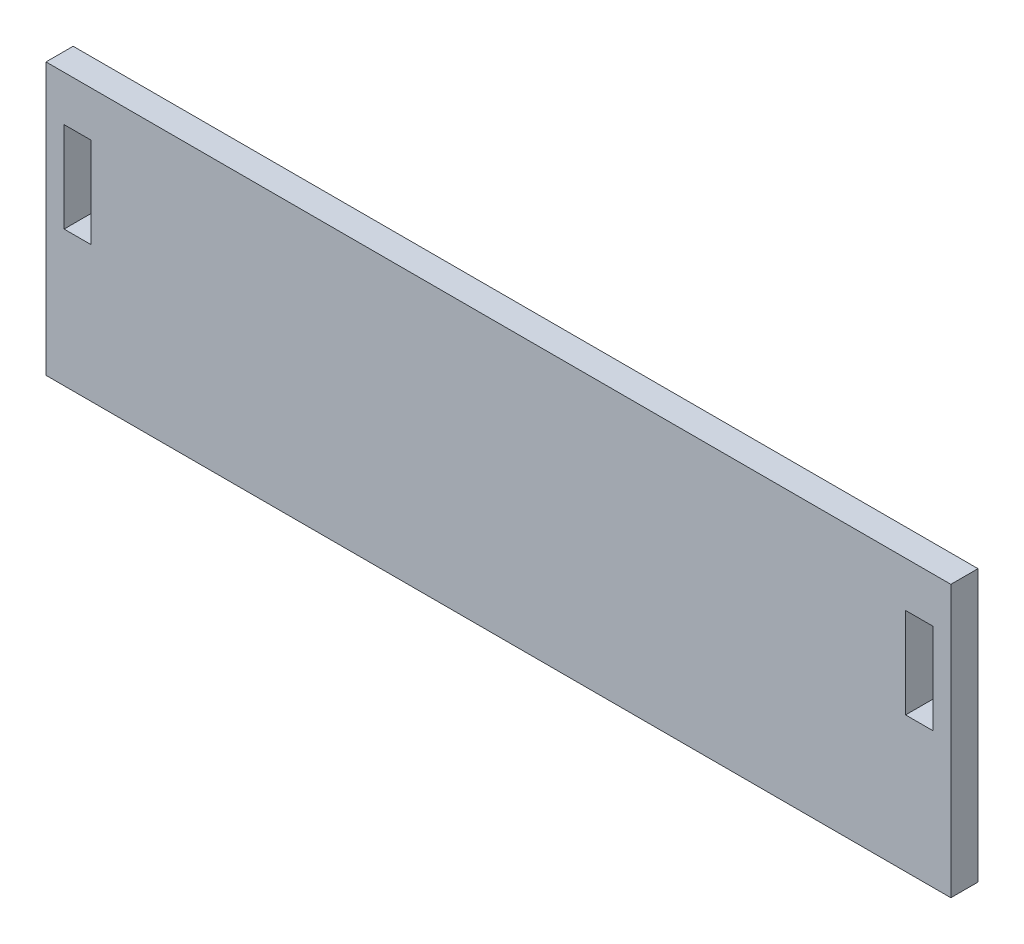
ISO-10303-21;
HEADER;
FILE_DESCRIPTION(('STEP AP214'),'2;1');
FILE_NAME('part.step','',(''),(''),'','','');
FILE_SCHEMA(('AUTOMOTIVE_DESIGN { 1 0 10303 214 1 1 1 1 }'));
ENDSEC;
DATA;
#1=APPLICATION_CONTEXT('core data for automotive mechanical design processes');
#2=APPLICATION_PROTOCOL_DEFINITION('international standard','automotive_design',2000,#1);
#3=PRODUCT_CONTEXT('',#1,'mechanical');
#4=PRODUCT('Part','Part','',(#3));
#5=PRODUCT_RELATED_PRODUCT_CATEGORY('part','',(#4));
#6=PRODUCT_DEFINITION_FORMATION('','',#4);
#7=PRODUCT_DEFINITION_CONTEXT('part definition',#1,'design');
#8=PRODUCT_DEFINITION('design','',#6,#7);
#9=PRODUCT_DEFINITION_SHAPE('','',#8);
#10=(LENGTH_UNIT() NAMED_UNIT(*) SI_UNIT(.MILLI.,.METRE.));
#11=(NAMED_UNIT(*) PLANE_ANGLE_UNIT() SI_UNIT($,.RADIAN.));
#12=(NAMED_UNIT(*) SI_UNIT($,.STERADIAN.) SOLID_ANGLE_UNIT());
#13=UNCERTAINTY_MEASURE_WITH_UNIT(LENGTH_MEASURE(1.E-05),#10,'distance_accuracy_value','');
#14=(GEOMETRIC_REPRESENTATION_CONTEXT(3) GLOBAL_UNCERTAINTY_ASSIGNED_CONTEXT((#13)) GLOBAL_UNIT_ASSIGNED_CONTEXT((#10,
#11,#12)) REPRESENTATION_CONTEXT('',''));
#15=CARTESIAN_POINT('',(0.,0.,0.));
#16=DIRECTION('',(0.,0.,1.));
#17=DIRECTION('',(1.,0.,0.));
#18=AXIS2_PLACEMENT_3D('',#15,#16,#17);
#19=CARTESIAN_POINT('',(0.,0.,3.));
#20=DIRECTION('',(0.,0.,-1.));
#21=DIRECTION('',(-1.,0.,0.));
#22=AXIS2_PLACEMENT_3D('',#19,#20,#21);
#23=PLANE('',#22);
#24=DIRECTION('',(0.,1.,0.));
#25=VECTOR('',#24,1.);
#26=CARTESIAN_POINT('',(-45.,10.,3.));
#27=LINE('',#26,#25);
#28=CARTESIAN_POINT('',(-45.,0.,3.));
#29=VERTEX_POINT('',#28);
#30=CARTESIAN_POINT('',(-45.,10.,3.));
#31=VERTEX_POINT('',#30);
#32=EDGE_CURVE('E158',#29,#31,#27,.T.);
#33=ORIENTED_EDGE('',*,*,#32,.F.);
#34=DIRECTION('',(1.,0.,0.));
#35=VECTOR('',#34,1.);
#36=CARTESIAN_POINT('',(-48.,0.,3.));
#37=LINE('',#36,#35);
#38=CARTESIAN_POINT('',(-48.,0.,3.));
#39=VERTEX_POINT('',#38);
#40=EDGE_CURVE('E166',#39,#29,#37,.T.);
#41=ORIENTED_EDGE('',*,*,#40,.F.);
#42=DIRECTION('',(0.,-1.,0.));
#43=VECTOR('',#42,1.);
#44=CARTESIAN_POINT('',(-48.,10.,3.));
#45=LINE('',#44,#43);
#46=CARTESIAN_POINT('',(-48.,10.,3.));
#47=VERTEX_POINT('',#46);
#48=EDGE_CURVE('E163',#47,#39,#45,.T.);
#49=ORIENTED_EDGE('',*,*,#48,.F.);
#50=DIRECTION('',(-1.,0.,0.));
#51=VECTOR('',#50,1.);
#52=CARTESIAN_POINT('',(-48.,10.,3.));
#53=LINE('',#52,#51);
#54=EDGE_CURVE('E160',#31,#47,#53,.T.);
#55=ORIENTED_EDGE('',*,*,#54,.F.);
#56=EDGE_LOOP('',(#33,#41,#49,#55));
#57=FACE_BOUND('',#56,.T.);
#58=DIRECTION('',(0.,-1.,0.));
#59=VECTOR('',#58,1.);
#60=CARTESIAN_POINT('',(-50.,15.,3.));
#61=LINE('',#60,#59);
#62=CARTESIAN_POINT('',(-50.,15.,3.));
#63=VERTEX_POINT('',#62);
#64=CARTESIAN_POINT('',(-50.,-15.,3.));
#65=VERTEX_POINT('',#64);
#66=EDGE_CURVE('E189',#63,#65,#61,.T.);
#67=ORIENTED_EDGE('',*,*,#66,.T.);
#68=DIRECTION('',(1.,0.,0.));
#69=VECTOR('',#68,1.);
#70=CARTESIAN_POINT('',(50.,-15.,3.));
#71=LINE('',#70,#69);
#72=CARTESIAN_POINT('',(50.,-15.,3.));
#73=VERTEX_POINT('',#72);
#74=EDGE_CURVE('E192',#65,#73,#71,.T.);
#75=ORIENTED_EDGE('',*,*,#74,.T.);
#76=DIRECTION('',(0.,1.,0.));
#77=VECTOR('',#76,1.);
#78=CARTESIAN_POINT('',(50.,15.,3.));
#79=LINE('',#78,#77);
#80=CARTESIAN_POINT('',(50.,15.,3.));
#81=VERTEX_POINT('',#80);
#82=EDGE_CURVE('E195',#73,#81,#79,.T.);
#83=ORIENTED_EDGE('',*,*,#82,.T.);
#84=DIRECTION('',(-1.,0.,0.));
#85=VECTOR('',#84,1.);
#86=CARTESIAN_POINT('',(50.,15.,3.));
#87=LINE('',#86,#85);
#88=EDGE_CURVE('E197',#81,#63,#87,.T.);
#89=ORIENTED_EDGE('',*,*,#88,.T.);
#90=EDGE_LOOP('',(#67,#75,#83,#89));
#91=FACE_BOUND('',#90,.T.);
#92=DIRECTION('',(0.,1.,0.));
#93=VECTOR('',#92,1.);
#94=CARTESIAN_POINT('',(48.,10.,3.));
#95=LINE('',#94,#93);
#96=CARTESIAN_POINT('',(48.,0.,3.));
#97=VERTEX_POINT('',#96);
#98=CARTESIAN_POINT('',(48.,10.,3.));
#99=VERTEX_POINT('',#98);
#100=EDGE_CURVE('E122',#97,#99,#95,.T.);
#101=ORIENTED_EDGE('',*,*,#100,.F.);
#102=DIRECTION('',(1.,0.,0.));
#103=VECTOR('',#102,1.);
#104=CARTESIAN_POINT('',(45.,0.,3.));
#105=LINE('',#104,#103);
#106=CARTESIAN_POINT('',(45.,0.,3.));
#107=VERTEX_POINT('',#106);
#108=EDGE_CURVE('E144',#107,#97,#105,.T.);
#109=ORIENTED_EDGE('',*,*,#108,.F.);
#110=DIRECTION('',(0.,-1.,0.));
#111=VECTOR('',#110,1.);
#112=CARTESIAN_POINT('',(45.,10.,3.));
#113=LINE('',#112,#111);
#114=CARTESIAN_POINT('',(45.,10.,3.));
#115=VERTEX_POINT('',#114);
#116=EDGE_CURVE('E142',#115,#107,#113,.T.);
#117=ORIENTED_EDGE('',*,*,#116,.F.);
#118=DIRECTION('',(-1.,0.,0.));
#119=VECTOR('',#118,1.);
#120=CARTESIAN_POINT('',(45.,10.,3.));
#121=LINE('',#120,#119);
#122=EDGE_CURVE('E130',#99,#115,#121,.T.);
#123=ORIENTED_EDGE('',*,*,#122,.F.);
#124=EDGE_LOOP('',(#101,#109,#117,#123));
#125=FACE_BOUND('',#124,.T.);
#126=ADVANCED_FACE('F33',(#57,#91,#125),#23,.F.);
#127=CARTESIAN_POINT('',(0.,0.,0.));
#128=DIRECTION('',(0.,0.,-1.));
#129=DIRECTION('',(-1.,0.,0.));
#130=AXIS2_PLACEMENT_3D('',#127,#128,#129);
#131=PLANE('',#130);
#132=DIRECTION('',(0.,-1.,0.));
#133=VECTOR('',#132,1.);
#134=CARTESIAN_POINT('',(-50.,15.,0.));
#135=LINE('',#134,#133);
#136=CARTESIAN_POINT('',(-50.,15.,0.));
#137=VERTEX_POINT('',#136);
#138=CARTESIAN_POINT('',(-50.,-15.,0.));
#139=VERTEX_POINT('',#138);
#140=EDGE_CURVE('E188',#137,#139,#135,.T.);
#141=ORIENTED_EDGE('',*,*,#140,.F.);
#142=DIRECTION('',(-1.,0.,0.));
#143=VECTOR('',#142,1.);
#144=CARTESIAN_POINT('',(50.,15.,0.));
#145=LINE('',#144,#143);
#146=CARTESIAN_POINT('',(50.,15.,0.));
#147=VERTEX_POINT('',#146);
#148=EDGE_CURVE('E193',#147,#137,#145,.T.);
#149=ORIENTED_EDGE('',*,*,#148,.F.);
#150=DIRECTION('',(0.,1.,0.));
#151=VECTOR('',#150,1.);
#152=CARTESIAN_POINT('',(50.,15.,0.));
#153=LINE('',#152,#151);
#154=CARTESIAN_POINT('',(50.,-15.,0.));
#155=VERTEX_POINT('',#154);
#156=EDGE_CURVE('E204',#155,#147,#153,.T.);
#157=ORIENTED_EDGE('',*,*,#156,.F.);
#158=DIRECTION('',(1.,0.,0.));
#159=VECTOR('',#158,1.);
#160=CARTESIAN_POINT('',(50.,-15.,0.));
#161=LINE('',#160,#159);
#162=EDGE_CURVE('E202',#139,#155,#161,.T.);
#163=ORIENTED_EDGE('',*,*,#162,.F.);
#164=EDGE_LOOP('',(#141,#149,#157,#163));
#165=FACE_BOUND('',#164,.T.);
#166=DIRECTION('',(1.,0.,0.));
#167=VECTOR('',#166,1.);
#168=CARTESIAN_POINT('',(-48.,0.,0.));
#169=LINE('',#168,#167);
#170=CARTESIAN_POINT('',(-48.,0.,0.));
#171=VERTEX_POINT('',#170);
#172=CARTESIAN_POINT('',(-45.,0.,0.));
#173=VERTEX_POINT('',#172);
#174=EDGE_CURVE('E161',#171,#173,#169,.T.);
#175=ORIENTED_EDGE('',*,*,#174,.T.);
#176=DIRECTION('',(0.,1.,0.));
#177=VECTOR('',#176,1.);
#178=CARTESIAN_POINT('',(-45.,10.,0.));
#179=LINE('',#178,#177);
#180=CARTESIAN_POINT('',(-45.,10.,0.));
#181=VERTEX_POINT('',#180);
#182=EDGE_CURVE('E138',#173,#181,#179,.T.);
#183=ORIENTED_EDGE('',*,*,#182,.T.);
#184=DIRECTION('',(-1.,0.,0.));
#185=VECTOR('',#184,1.);
#186=CARTESIAN_POINT('',(-48.,10.,0.));
#187=LINE('',#186,#185);
#188=CARTESIAN_POINT('',(-48.,10.,0.));
#189=VERTEX_POINT('',#188);
#190=EDGE_CURVE('E171',#181,#189,#187,.T.);
#191=ORIENTED_EDGE('',*,*,#190,.T.);
#192=DIRECTION('',(0.,-1.,0.));
#193=VECTOR('',#192,1.);
#194=CARTESIAN_POINT('',(-48.,10.,0.));
#195=LINE('',#194,#193);
#196=EDGE_CURVE('E174',#189,#171,#195,.T.);
#197=ORIENTED_EDGE('',*,*,#196,.T.);
#198=EDGE_LOOP('',(#175,#183,#191,#197));
#199=FACE_BOUND('',#198,.T.);
#200=DIRECTION('',(1.,0.,0.));
#201=VECTOR('',#200,1.);
#202=CARTESIAN_POINT('',(45.,0.,0.));
#203=LINE('',#202,#201);
#204=CARTESIAN_POINT('',(45.,0.,0.));
#205=VERTEX_POINT('',#204);
#206=CARTESIAN_POINT('',(48.,0.,0.));
#207=VERTEX_POINT('',#206);
#208=EDGE_CURVE('E131',#205,#207,#203,.T.);
#209=ORIENTED_EDGE('',*,*,#208,.T.);
#210=DIRECTION('',(0.,1.,0.));
#211=VECTOR('',#210,1.);
#212=CARTESIAN_POINT('',(48.,10.,0.));
#213=LINE('',#212,#211);
#214=CARTESIAN_POINT('',(48.,10.,0.));
#215=VERTEX_POINT('',#214);
#216=EDGE_CURVE('E56',#207,#215,#213,.T.);
#217=ORIENTED_EDGE('',*,*,#216,.T.);
#218=DIRECTION('',(-1.,0.,0.));
#219=VECTOR('',#218,1.);
#220=CARTESIAN_POINT('',(45.,10.,0.));
#221=LINE('',#220,#219);
#222=CARTESIAN_POINT('',(45.,10.,0.));
#223=VERTEX_POINT('',#222);
#224=EDGE_CURVE('E137',#215,#223,#221,.T.);
#225=ORIENTED_EDGE('',*,*,#224,.T.);
#226=DIRECTION('',(0.,-1.,0.));
#227=VECTOR('',#226,1.);
#228=CARTESIAN_POINT('',(45.,10.,0.));
#229=LINE('',#228,#227);
#230=EDGE_CURVE('E150',#223,#205,#229,.T.);
#231=ORIENTED_EDGE('',*,*,#230,.T.);
#232=EDGE_LOOP('',(#209,#217,#225,#231));
#233=FACE_BOUND('',#232,.T.);
#234=ADVANCED_FACE('F222',(#165,#199,#233),#131,.T.);
#235=CARTESIAN_POINT('',(-50.,15.,3.));
#236=DIRECTION('',(1.,0.,0.));
#237=DIRECTION('',(0.,1.,0.));
#238=AXIS2_PLACEMENT_3D('',#235,#236,#237);
#239=PLANE('',#238);
#240=ORIENTED_EDGE('',*,*,#140,.T.);
#241=DIRECTION('',(0.,0.,-1.));
#242=VECTOR('',#241,1.);
#243=CARTESIAN_POINT('',(-50.,-15.,3.));
#244=LINE('',#243,#242);
#245=EDGE_CURVE('E11',#65,#139,#244,.T.);
#246=ORIENTED_EDGE('',*,*,#245,.F.);
#247=ORIENTED_EDGE('',*,*,#66,.F.);
#248=DIRECTION('',(0.,0.,-1.));
#249=VECTOR('',#248,1.);
#250=CARTESIAN_POINT('',(-50.,15.,3.));
#251=LINE('',#250,#249);
#252=EDGE_CURVE('E199',#63,#137,#251,.T.);
#253=ORIENTED_EDGE('',*,*,#252,.T.);
#254=EDGE_LOOP('',(#240,#246,#247,#253));
#255=FACE_BOUND('',#254,.T.);
#256=ADVANCED_FACE('F35',(#255),#239,.F.);
#257=CARTESIAN_POINT('',(50.,-15.,3.));
#258=DIRECTION('',(0.,1.,0.));
#259=DIRECTION('',(-1.,0.,0.));
#260=AXIS2_PLACEMENT_3D('',#257,#258,#259);
#261=PLANE('',#260);
#262=ORIENTED_EDGE('',*,*,#162,.T.);
#263=DIRECTION('',(0.,0.,-1.));
#264=VECTOR('',#263,1.);
#265=CARTESIAN_POINT('',(50.,-15.,3.));
#266=LINE('',#265,#264);
#267=EDGE_CURVE('E41',#73,#155,#266,.T.);
#268=ORIENTED_EDGE('',*,*,#267,.F.);
#269=ORIENTED_EDGE('',*,*,#74,.F.);
#270=ORIENTED_EDGE('',*,*,#245,.T.);
#271=EDGE_LOOP('',(#262,#268,#269,#270));
#272=FACE_BOUND('',#271,.T.);
#273=ADVANCED_FACE('F232',(#272),#261,.F.);
#274=CARTESIAN_POINT('',(50.,15.,3.));
#275=DIRECTION('',(-1.,0.,0.));
#276=DIRECTION('',(0.,-1.,0.));
#277=AXIS2_PLACEMENT_3D('',#274,#275,#276);
#278=PLANE('',#277);
#279=ORIENTED_EDGE('',*,*,#156,.T.);
#280=DIRECTION('',(0.,0.,-1.));
#281=VECTOR('',#280,1.);
#282=CARTESIAN_POINT('',(50.,15.,3.));
#283=LINE('',#282,#281);
#284=EDGE_CURVE('E209',#81,#147,#283,.T.);
#285=ORIENTED_EDGE('',*,*,#284,.F.);
#286=ORIENTED_EDGE('',*,*,#82,.F.);
#287=ORIENTED_EDGE('',*,*,#267,.T.);
#288=EDGE_LOOP('',(#279,#285,#286,#287));
#289=FACE_BOUND('',#288,.T.);
#290=ADVANCED_FACE('F216',(#289),#278,.F.);
#291=CARTESIAN_POINT('',(50.,15.,3.));
#292=DIRECTION('',(0.,-1.,0.));
#293=DIRECTION('',(1.,0.,0.));
#294=AXIS2_PLACEMENT_3D('',#291,#292,#293);
#295=PLANE('',#294);
#296=ORIENTED_EDGE('',*,*,#148,.T.);
#297=ORIENTED_EDGE('',*,*,#252,.F.);
#298=ORIENTED_EDGE('',*,*,#88,.F.);
#299=ORIENTED_EDGE('',*,*,#284,.T.);
#300=EDGE_LOOP('',(#296,#297,#298,#299));
#301=FACE_BOUND('',#300,.T.);
#302=ADVANCED_FACE('F226',(#301),#295,.F.);
#303=CARTESIAN_POINT('',(-45.,10.,3.));
#304=DIRECTION('',(-1.,0.,0.));
#305=DIRECTION('',(0.,0.,1.));
#306=AXIS2_PLACEMENT_3D('',#303,#304,#305);
#307=PLANE('',#306);
#308=ORIENTED_EDGE('',*,*,#182,.F.);
#309=DIRECTION('',(0.,0.,-1.));
#310=VECTOR('',#309,1.);
#311=CARTESIAN_POINT('',(-45.,0.,3.));
#312=LINE('',#311,#310);
#313=EDGE_CURVE('E168',#29,#173,#312,.T.);
#314=ORIENTED_EDGE('',*,*,#313,.F.);
#315=ORIENTED_EDGE('',*,*,#32,.T.);
#316=DIRECTION('',(0.,0.,-1.));
#317=VECTOR('',#316,1.);
#318=CARTESIAN_POINT('',(-45.,10.,3.));
#319=LINE('',#318,#317);
#320=EDGE_CURVE('E185',#31,#181,#319,.T.);
#321=ORIENTED_EDGE('',*,*,#320,.T.);
#322=EDGE_LOOP('',(#308,#314,#315,#321));
#323=FACE_BOUND('',#322,.T.);
#324=ADVANCED_FACE('F248',(#323),#307,.T.);
#325=CARTESIAN_POINT('',(-48.,10.,3.));
#326=DIRECTION('',(0.,-1.,0.));
#327=DIRECTION('',(0.,0.,-1.));
#328=AXIS2_PLACEMENT_3D('',#325,#326,#327);
#329=PLANE('',#328);
#330=ORIENTED_EDGE('',*,*,#190,.F.);
#331=ORIENTED_EDGE('',*,*,#320,.F.);
#332=ORIENTED_EDGE('',*,*,#54,.T.);
#333=DIRECTION('',(0.,0.,-1.));
#334=VECTOR('',#333,1.);
#335=CARTESIAN_POINT('',(-48.,10.,3.));
#336=LINE('',#335,#334);
#337=EDGE_CURVE('E183',#47,#189,#336,.T.);
#338=ORIENTED_EDGE('',*,*,#337,.T.);
#339=EDGE_LOOP('',(#330,#331,#332,#338));
#340=FACE_BOUND('',#339,.T.);
#341=ADVANCED_FACE('F255',(#340),#329,.T.);
#342=CARTESIAN_POINT('',(-48.,10.,3.));
#343=DIRECTION('',(1.,0.,0.));
#344=DIRECTION('',(0.,0.,-1.));
#345=AXIS2_PLACEMENT_3D('',#342,#343,#344);
#346=PLANE('',#345);
#347=ORIENTED_EDGE('',*,*,#196,.F.);
#348=ORIENTED_EDGE('',*,*,#337,.F.);
#349=ORIENTED_EDGE('',*,*,#48,.T.);
#350=DIRECTION('',(0.,0.,-1.));
#351=VECTOR('',#350,1.);
#352=CARTESIAN_POINT('',(-48.,0.,3.));
#353=LINE('',#352,#351);
#354=EDGE_CURVE('E181',#39,#171,#353,.T.);
#355=ORIENTED_EDGE('',*,*,#354,.T.);
#356=EDGE_LOOP('',(#347,#348,#349,#355));
#357=FACE_BOUND('',#356,.T.);
#358=ADVANCED_FACE('F260',(#357),#346,.T.);
#359=CARTESIAN_POINT('',(-48.,0.,3.));
#360=DIRECTION('',(0.,1.,0.));
#361=DIRECTION('',(0.,0.,1.));
#362=AXIS2_PLACEMENT_3D('',#359,#360,#361);
#363=PLANE('',#362);
#364=ORIENTED_EDGE('',*,*,#174,.F.);
#365=ORIENTED_EDGE('',*,*,#354,.F.);
#366=ORIENTED_EDGE('',*,*,#40,.T.);
#367=ORIENTED_EDGE('',*,*,#313,.T.);
#368=EDGE_LOOP('',(#364,#365,#366,#367));
#369=FACE_BOUND('',#368,.T.);
#370=ADVANCED_FACE('F266',(#369),#363,.T.);
#371=CARTESIAN_POINT('',(48.,10.,3.));
#372=DIRECTION('',(-1.,0.,0.));
#373=DIRECTION('',(0.,0.,1.));
#374=AXIS2_PLACEMENT_3D('',#371,#372,#373);
#375=PLANE('',#374);
#376=ORIENTED_EDGE('',*,*,#216,.F.);
#377=DIRECTION('',(0.,0.,-1.));
#378=VECTOR('',#377,1.);
#379=CARTESIAN_POINT('',(48.,0.,3.));
#380=LINE('',#379,#378);
#381=EDGE_CURVE('E126',#97,#207,#380,.T.);
#382=ORIENTED_EDGE('',*,*,#381,.F.);
#383=ORIENTED_EDGE('',*,*,#100,.T.);
#384=DIRECTION('',(0.,0.,-1.));
#385=VECTOR('',#384,1.);
#386=CARTESIAN_POINT('',(48.,10.,3.));
#387=LINE('',#386,#385);
#388=EDGE_CURVE('E125',#99,#215,#387,.T.);
#389=ORIENTED_EDGE('',*,*,#388,.T.);
#390=EDGE_LOOP('',(#376,#382,#383,#389));
#391=FACE_BOUND('',#390,.T.);
#392=ADVANCED_FACE('F124',(#391),#375,.T.);
#393=CARTESIAN_POINT('',(45.,10.,3.));
#394=DIRECTION('',(0.,-1.,0.));
#395=DIRECTION('',(0.,0.,-1.));
#396=AXIS2_PLACEMENT_3D('',#393,#394,#395);
#397=PLANE('',#396);
#398=ORIENTED_EDGE('',*,*,#224,.F.);
#399=ORIENTED_EDGE('',*,*,#388,.F.);
#400=ORIENTED_EDGE('',*,*,#122,.T.);
#401=DIRECTION('',(0.,0.,-1.));
#402=VECTOR('',#401,1.);
#403=CARTESIAN_POINT('',(45.,10.,3.));
#404=LINE('',#403,#402);
#405=EDGE_CURVE('E139',#115,#223,#404,.T.);
#406=ORIENTED_EDGE('',*,*,#405,.T.);
#407=EDGE_LOOP('',(#398,#399,#400,#406));
#408=FACE_BOUND('',#407,.T.);
#409=ADVANCED_FACE('F134',(#408),#397,.T.);
#410=CARTESIAN_POINT('',(45.,10.,3.));
#411=DIRECTION('',(1.,0.,0.));
#412=DIRECTION('',(0.,0.,-1.));
#413=AXIS2_PLACEMENT_3D('',#410,#411,#412);
#414=PLANE('',#413);
#415=ORIENTED_EDGE('',*,*,#230,.F.);
#416=ORIENTED_EDGE('',*,*,#405,.F.);
#417=ORIENTED_EDGE('',*,*,#116,.T.);
#418=DIRECTION('',(0.,0.,-1.));
#419=VECTOR('',#418,1.);
#420=CARTESIAN_POINT('',(45.,0.,3.));
#421=LINE('',#420,#419);
#422=EDGE_CURVE('E48',#107,#205,#421,.T.);
#423=ORIENTED_EDGE('',*,*,#422,.T.);
#424=EDGE_LOOP('',(#415,#416,#417,#423));
#425=FACE_BOUND('',#424,.T.);
#426=ADVANCED_FACE('F285',(#425),#414,.T.);
#427=CARTESIAN_POINT('',(45.,0.,3.));
#428=DIRECTION('',(0.,1.,0.));
#429=DIRECTION('',(0.,0.,1.));
#430=AXIS2_PLACEMENT_3D('',#427,#428,#429);
#431=PLANE('',#430);
#432=ORIENTED_EDGE('',*,*,#208,.F.);
#433=ORIENTED_EDGE('',*,*,#422,.F.);
#434=ORIENTED_EDGE('',*,*,#108,.T.);
#435=ORIENTED_EDGE('',*,*,#381,.T.);
#436=EDGE_LOOP('',(#432,#433,#434,#435));
#437=FACE_BOUND('',#436,.T.);
#438=ADVANCED_FACE('F288',(#437),#431,.T.);
#439=CLOSED_SHELL('',(#126,#234,#256,#273,#290,#302,#324,#341,#358,#370,#392,#409,#426,#438));
#440=MANIFOLD_SOLID_BREP('B2',#439);
#441=ADVANCED_BREP_SHAPE_REPRESENTATION('',(#18,#440),#14);
#442=SHAPE_DEFINITION_REPRESENTATION(#9,#441);
ENDSEC;
END-ISO-10303-21;
